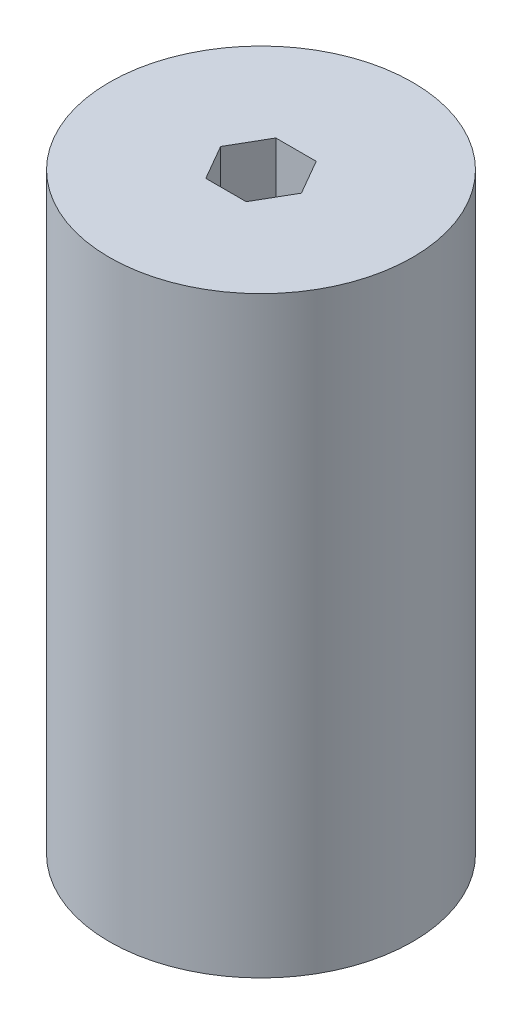
ISO-10303-21;
HEADER;
FILE_DESCRIPTION(('STEP AP214'),'2;1');
FILE_NAME('part.step','',(''),(''),'','','');
FILE_SCHEMA(('AUTOMOTIVE_DESIGN { 1 0 10303 214 1 1 1 1 }'));
ENDSEC;
DATA;
#1=APPLICATION_CONTEXT('core data for automotive mechanical design processes');
#2=APPLICATION_PROTOCOL_DEFINITION('international standard','automotive_design',2000,#1);
#3=PRODUCT_CONTEXT('',#1,'mechanical');
#4=PRODUCT('Part','Part','',(#3));
#5=PRODUCT_RELATED_PRODUCT_CATEGORY('part','',(#4));
#6=PRODUCT_DEFINITION_FORMATION('','',#4);
#7=PRODUCT_DEFINITION_CONTEXT('part definition',#1,'design');
#8=PRODUCT_DEFINITION('design','',#6,#7);
#9=PRODUCT_DEFINITION_SHAPE('','',#8);
#10=(LENGTH_UNIT() NAMED_UNIT(*) SI_UNIT(.MILLI.,.METRE.));
#11=(NAMED_UNIT(*) PLANE_ANGLE_UNIT() SI_UNIT($,.RADIAN.));
#12=(NAMED_UNIT(*) SI_UNIT($,.STERADIAN.) SOLID_ANGLE_UNIT());
#13=UNCERTAINTY_MEASURE_WITH_UNIT(LENGTH_MEASURE(1.E-05),#10,'distance_accuracy_value','');
#14=(GEOMETRIC_REPRESENTATION_CONTEXT(3) GLOBAL_UNCERTAINTY_ASSIGNED_CONTEXT((#13)) GLOBAL_UNIT_ASSIGNED_CONTEXT((#10,
#11,#12)) REPRESENTATION_CONTEXT('',''));
#15=CARTESIAN_POINT('',(0.,0.,0.));
#16=DIRECTION('',(0.,0.,1.));
#17=DIRECTION('',(1.,0.,0.));
#18=AXIS2_PLACEMENT_3D('',#15,#16,#17);
#19=CARTESIAN_POINT('',(0.,127.,0.));
#20=DIRECTION('',(0.,1.,0.));
#21=DIRECTION('',(0.,0.,1.));
#22=AXIS2_PLACEMENT_3D('',#19,#20,#21);
#23=PLANE('',#22);
#24=CARTESIAN_POINT('',(0.,127.,0.));
#25=DIRECTION('',(0.,1.,0.));
#26=DIRECTION('',(0.,0.,1.));
#27=AXIS2_PLACEMENT_3D('',#24,#25,#26);
#28=CIRCLE('',#27,32.5);
#29=CARTESIAN_POINT('',(0.,127.,32.5));
#30=VERTEX_POINT('',#29);
#31=EDGE_CURVE('E11',#30,#30,#28,.T.);
#32=ORIENTED_EDGE('',*,*,#31,.T.);
#33=EDGE_LOOP('',(#32));
#34=FACE_BOUND('',#33,.T.);
#35=DIRECTION('',(-0.5,0.,-0.866025403784438));
#36=VECTOR('',#35,1.);
#37=CARTESIAN_POINT('',(8.66025403784439,127.,0.));
#38=LINE('',#37,#36);
#39=CARTESIAN_POINT('',(8.66025403784439,127.,0.));
#40=VERTEX_POINT('',#39);
#41=CARTESIAN_POINT('',(4.33012701892219,127.,-7.50000000000001));
#42=VERTEX_POINT('',#41);
#43=EDGE_CURVE('E94',#40,#42,#38,.T.);
#44=ORIENTED_EDGE('',*,*,#43,.F.);
#45=DIRECTION('',(0.5,0.,-0.866025403784439));
#46=VECTOR('',#45,1.);
#47=CARTESIAN_POINT('',(4.33012701892219,127.,7.50000000000001));
#48=LINE('',#47,#46);
#49=CARTESIAN_POINT('',(4.33012701892219,127.,7.50000000000001));
#50=VERTEX_POINT('',#49);
#51=EDGE_CURVE('E86',#50,#40,#48,.T.);
#52=ORIENTED_EDGE('',*,*,#51,.F.);
#53=DIRECTION('',(1.,0.,0.));
#54=VECTOR('',#53,1.);
#55=CARTESIAN_POINT('',(-4.33012701892219,127.,7.5));
#56=LINE('',#55,#54);
#57=CARTESIAN_POINT('',(-4.33012701892219,127.,7.50000000000001));
#58=VERTEX_POINT('',#57);
#59=EDGE_CURVE('E114',#58,#50,#56,.T.);
#60=ORIENTED_EDGE('',*,*,#59,.F.);
#61=DIRECTION('',(0.5,0.,0.866025403784439));
#62=VECTOR('',#61,1.);
#63=CARTESIAN_POINT('',(-8.66025403784439,127.,0.));
#64=LINE('',#63,#62);
#65=CARTESIAN_POINT('',(-8.66025403784439,127.,0.));
#66=VERTEX_POINT('',#65);
#67=EDGE_CURVE('E112',#66,#58,#64,.T.);
#68=ORIENTED_EDGE('',*,*,#67,.F.);
#69=DIRECTION('',(-0.5,0.,0.866025403784439));
#70=VECTOR('',#69,1.);
#71=CARTESIAN_POINT('',(-4.33012701892219,127.,-7.50000000000001));
#72=LINE('',#71,#70);
#73=CARTESIAN_POINT('',(-4.33012701892219,127.,-7.50000000000001));
#74=VERTEX_POINT('',#73);
#75=EDGE_CURVE('E108',#74,#66,#72,.T.);
#76=ORIENTED_EDGE('',*,*,#75,.F.);
#77=DIRECTION('',(-1.,0.,0.));
#78=VECTOR('',#77,1.);
#79=CARTESIAN_POINT('',(4.33012701892219,127.,-7.50000000000001));
#80=LINE('',#79,#78);
#81=EDGE_CURVE('E106',#42,#74,#80,.T.);
#82=ORIENTED_EDGE('',*,*,#81,.F.);
#83=EDGE_LOOP('',(#44,#52,#60,#68,#76,#82));
#84=FACE_BOUND('',#83,.T.);
#85=ADVANCED_FACE('F33',(#34,#84),#23,.T.);
#86=CARTESIAN_POINT('',(0.,0.,0.));
#87=DIRECTION('',(0.,1.,0.));
#88=DIRECTION('',(0.,0.,1.));
#89=AXIS2_PLACEMENT_3D('',#86,#87,#88);
#90=PLANE('',#89);
#91=CARTESIAN_POINT('',(0.,0.,0.));
#92=DIRECTION('',(0.,1.,0.));
#93=DIRECTION('',(0.,0.,1.));
#94=AXIS2_PLACEMENT_3D('',#91,#92,#93);
#95=CIRCLE('',#94,32.5);
#96=CARTESIAN_POINT('',(0.,0.,32.5));
#97=VERTEX_POINT('',#96);
#98=EDGE_CURVE('E37',#97,#97,#95,.T.);
#99=ORIENTED_EDGE('',*,*,#98,.F.);
#100=EDGE_LOOP('',(#99));
#101=FACE_BOUND('',#100,.T.);
#102=DIRECTION('',(0.5,0.,-0.866025403784439));
#103=VECTOR('',#102,1.);
#104=CARTESIAN_POINT('',(4.33012701892219,0.,7.50000000000001));
#105=LINE('',#104,#103);
#106=CARTESIAN_POINT('',(4.33012701892219,0.,7.50000000000001));
#107=VERTEX_POINT('',#106);
#108=CARTESIAN_POINT('',(8.66025403784439,0.,0.));
#109=VERTEX_POINT('',#108);
#110=EDGE_CURVE('E56',#107,#109,#105,.T.);
#111=ORIENTED_EDGE('',*,*,#110,.T.);
#112=DIRECTION('',(-0.5,0.,-0.866025403784438));
#113=VECTOR('',#112,1.);
#114=CARTESIAN_POINT('',(8.66025403784439,0.,0.));
#115=LINE('',#114,#113);
#116=CARTESIAN_POINT('',(4.33012701892219,0.,-7.50000000000001));
#117=VERTEX_POINT('',#116);
#118=EDGE_CURVE('E101',#109,#117,#115,.T.);
#119=ORIENTED_EDGE('',*,*,#118,.T.);
#120=DIRECTION('',(-1.,0.,0.));
#121=VECTOR('',#120,1.);
#122=CARTESIAN_POINT('',(4.33012701892219,0.,-7.50000000000001));
#123=LINE('',#122,#121);
#124=CARTESIAN_POINT('',(-4.33012701892219,0.,-7.50000000000001));
#125=VERTEX_POINT('',#124);
#126=EDGE_CURVE('E118',#117,#125,#123,.T.);
#127=ORIENTED_EDGE('',*,*,#126,.T.);
#128=DIRECTION('',(-0.5,0.,0.866025403784439));
#129=VECTOR('',#128,1.);
#130=CARTESIAN_POINT('',(-4.33012701892219,0.,-7.50000000000001));
#131=LINE('',#130,#129);
#132=CARTESIAN_POINT('',(-8.66025403784439,0.,0.));
#133=VERTEX_POINT('',#132);
#134=EDGE_CURVE('E121',#125,#133,#131,.T.);
#135=ORIENTED_EDGE('',*,*,#134,.T.);
#136=DIRECTION('',(0.5,0.,0.866025403784439));
#137=VECTOR('',#136,1.);
#138=CARTESIAN_POINT('',(-8.66025403784439,0.,0.));
#139=LINE('',#138,#137);
#140=CARTESIAN_POINT('',(-4.33012701892219,0.,7.5));
#141=VERTEX_POINT('',#140);
#142=EDGE_CURVE('E124',#133,#141,#139,.T.);
#143=ORIENTED_EDGE('',*,*,#142,.T.);
#144=DIRECTION('',(1.,0.,0.));
#145=VECTOR('',#144,1.);
#146=CARTESIAN_POINT('',(-4.33012701892219,0.,7.5));
#147=LINE('',#146,#145);
#148=EDGE_CURVE('E95',#141,#107,#147,.T.);
#149=ORIENTED_EDGE('',*,*,#148,.T.);
#150=EDGE_LOOP('',(#111,#119,#127,#135,#143,#149));
#151=FACE_BOUND('',#150,.T.);
#152=ADVANCED_FACE('F141',(#101,#151),#90,.F.);
#153=CARTESIAN_POINT('',(0.,127.,0.));
#154=DIRECTION('',(0.,-1.,0.));
#155=DIRECTION('',(0.,0.,-1.));
#156=AXIS2_PLACEMENT_3D('',#153,#154,#155);
#157=CYLINDRICAL_SURFACE('',#156,32.5);
#158=ORIENTED_EDGE('',*,*,#31,.F.);
#159=EDGE_LOOP('',(#158));
#160=FACE_BOUND('',#159,.T.);
#161=ORIENTED_EDGE('',*,*,#98,.T.);
#162=EDGE_LOOP('',(#161));
#163=FACE_BOUND('',#162,.T.);
#164=ADVANCED_FACE('F35',(#160,#163),#157,.T.);
#165=CARTESIAN_POINT('',(4.33012701892219,127.,7.50000000000001));
#166=DIRECTION('',(-0.866025403784439,0.,-0.499999999999999));
#167=DIRECTION('',(-0.5,0.,0.866025403784439));
#168=AXIS2_PLACEMENT_3D('',#165,#166,#167);
#169=PLANE('',#168);
#170=ORIENTED_EDGE('',*,*,#110,.F.);
#171=DIRECTION('',(0.,-1.,0.));
#172=VECTOR('',#171,1.);
#173=CARTESIAN_POINT('',(4.33012701892219,127.,7.50000000000001));
#174=LINE('',#173,#172);
#175=EDGE_CURVE('E90',#50,#107,#174,.T.);
#176=ORIENTED_EDGE('',*,*,#175,.F.);
#177=ORIENTED_EDGE('',*,*,#51,.T.);
#178=DIRECTION('',(0.,-1.,0.));
#179=VECTOR('',#178,1.);
#180=CARTESIAN_POINT('',(8.66025403784439,127.,0.));
#181=LINE('',#180,#179);
#182=EDGE_CURVE('E89',#40,#109,#181,.T.);
#183=ORIENTED_EDGE('',*,*,#182,.T.);
#184=EDGE_LOOP('',(#170,#176,#177,#183));
#185=FACE_BOUND('',#184,.T.);
#186=ADVANCED_FACE('F88',(#185),#169,.T.);
#187=CARTESIAN_POINT('',(8.66025403784439,127.,0.));
#188=DIRECTION('',(-0.866025403784438,0.,0.5));
#189=DIRECTION('',(0.5,0.,0.866025403784438));
#190=AXIS2_PLACEMENT_3D('',#187,#188,#189);
#191=PLANE('',#190);
#192=ORIENTED_EDGE('',*,*,#118,.F.);
#193=ORIENTED_EDGE('',*,*,#182,.F.);
#194=ORIENTED_EDGE('',*,*,#43,.T.);
#195=DIRECTION('',(0.,-1.,0.));
#196=VECTOR('',#195,1.);
#197=CARTESIAN_POINT('',(4.33012701892219,127.,-7.50000000000001));
#198=LINE('',#197,#196);
#199=EDGE_CURVE('E102',#42,#117,#198,.T.);
#200=ORIENTED_EDGE('',*,*,#199,.T.);
#201=EDGE_LOOP('',(#192,#193,#194,#200));
#202=FACE_BOUND('',#201,.T.);
#203=ADVANCED_FACE('F98',(#202),#191,.T.);
#204=CARTESIAN_POINT('',(4.33012701892219,127.,-7.50000000000001));
#205=DIRECTION('',(0.,0.,1.));
#206=DIRECTION('',(1.,0.,0.));
#207=AXIS2_PLACEMENT_3D('',#204,#205,#206);
#208=PLANE('',#207);
#209=ORIENTED_EDGE('',*,*,#126,.F.);
#210=ORIENTED_EDGE('',*,*,#199,.F.);
#211=ORIENTED_EDGE('',*,*,#81,.T.);
#212=DIRECTION('',(0.,-1.,0.));
#213=VECTOR('',#212,1.);
#214=CARTESIAN_POINT('',(-4.33012701892219,127.,-7.50000000000001));
#215=LINE('',#214,#213);
#216=EDGE_CURVE('E133',#74,#125,#215,.T.);
#217=ORIENTED_EDGE('',*,*,#216,.T.);
#218=EDGE_LOOP('',(#209,#210,#211,#217));
#219=FACE_BOUND('',#218,.T.);
#220=ADVANCED_FACE('F137',(#219),#208,.T.);
#221=CARTESIAN_POINT('',(-4.33012701892219,127.,-7.50000000000001));
#222=DIRECTION('',(0.866025403784439,0.,0.5));
#223=DIRECTION('',(0.5,0.,-0.866025403784439));
#224=AXIS2_PLACEMENT_3D('',#221,#222,#223);
#225=PLANE('',#224);
#226=ORIENTED_EDGE('',*,*,#134,.F.);
#227=ORIENTED_EDGE('',*,*,#216,.F.);
#228=ORIENTED_EDGE('',*,*,#75,.T.);
#229=DIRECTION('',(0.,-1.,0.));
#230=VECTOR('',#229,1.);
#231=CARTESIAN_POINT('',(-8.66025403784439,127.,0.));
#232=LINE('',#231,#230);
#233=EDGE_CURVE('E131',#66,#133,#232,.T.);
#234=ORIENTED_EDGE('',*,*,#233,.T.);
#235=EDGE_LOOP('',(#226,#227,#228,#234));
#236=FACE_BOUND('',#235,.T.);
#237=ADVANCED_FACE('F149',(#236),#225,.T.);
#238=CARTESIAN_POINT('',(-8.66025403784439,127.,0.));
#239=DIRECTION('',(0.866025403784439,0.,-0.5));
#240=DIRECTION('',(-0.5,0.,-0.866025403784439));
#241=AXIS2_PLACEMENT_3D('',#238,#239,#240);
#242=PLANE('',#241);
#243=ORIENTED_EDGE('',*,*,#142,.F.);
#244=ORIENTED_EDGE('',*,*,#233,.F.);
#245=ORIENTED_EDGE('',*,*,#67,.T.);
#246=DIRECTION('',(0.,-1.,0.));
#247=VECTOR('',#246,1.);
#248=CARTESIAN_POINT('',(-4.33012701892219,127.,7.5));
#249=LINE('',#248,#247);
#250=EDGE_CURVE('E48',#58,#141,#249,.T.);
#251=ORIENTED_EDGE('',*,*,#250,.T.);
#252=EDGE_LOOP('',(#243,#244,#245,#251));
#253=FACE_BOUND('',#252,.T.);
#254=ADVANCED_FACE('F147',(#253),#242,.T.);
#255=CARTESIAN_POINT('',(-4.33012701892219,127.,7.5));
#256=DIRECTION('',(0.,0.,-1.));
#257=DIRECTION('',(-1.,0.,0.));
#258=AXIS2_PLACEMENT_3D('',#255,#256,#257);
#259=PLANE('',#258);
#260=ORIENTED_EDGE('',*,*,#148,.F.);
#261=ORIENTED_EDGE('',*,*,#250,.F.);
#262=ORIENTED_EDGE('',*,*,#59,.T.);
#263=ORIENTED_EDGE('',*,*,#175,.T.);
#264=EDGE_LOOP('',(#260,#261,#262,#263));
#265=FACE_BOUND('',#264,.T.);
#266=ADVANCED_FACE('F143',(#265),#259,.T.);
#267=CLOSED_SHELL('',(#85,#152,#164,#186,#203,#220,#237,#254,#266));
#268=MANIFOLD_SOLID_BREP('B2',#267);
#269=ADVANCED_BREP_SHAPE_REPRESENTATION('',(#18,#268),#14);
#270=SHAPE_DEFINITION_REPRESENTATION(#9,#269);
ENDSEC;
END-ISO-10303-21;
